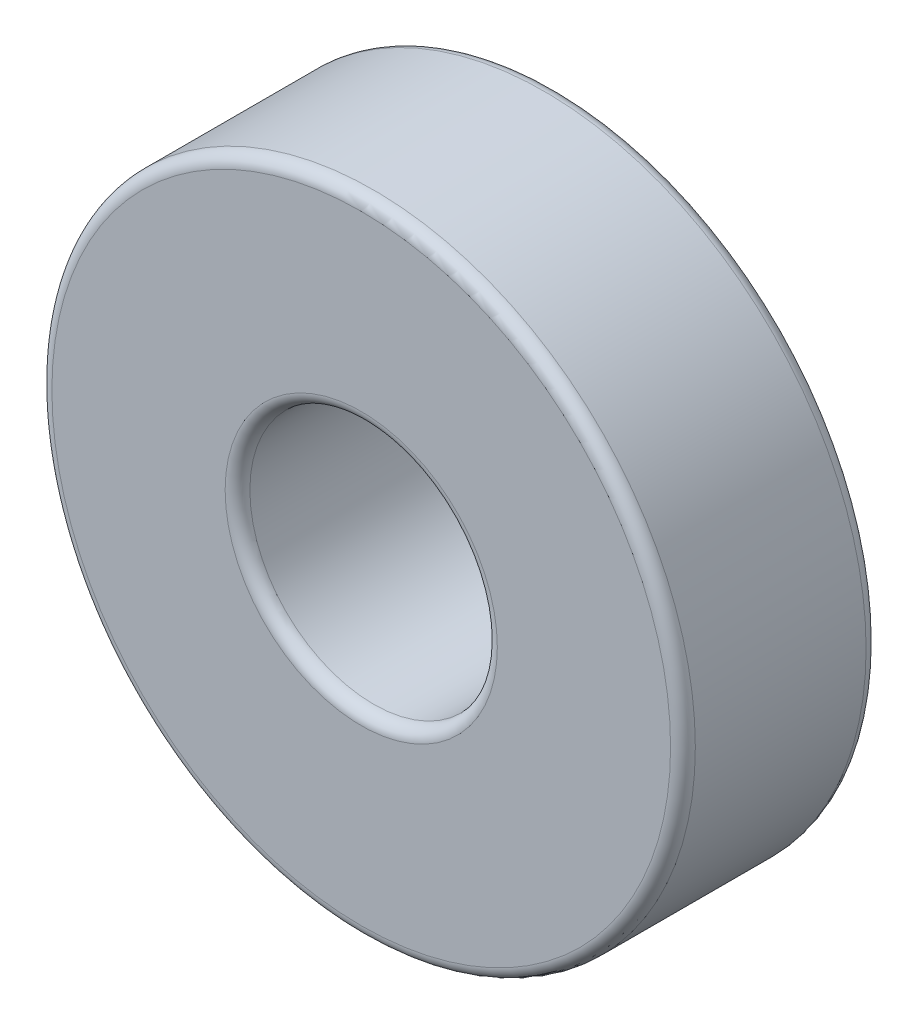
ISO-10303-21;
HEADER;
FILE_DESCRIPTION(('STEP AP214'),'2;1');
FILE_NAME('part.step','',(''),(''),'','','');
FILE_SCHEMA(('AUTOMOTIVE_DESIGN { 1 0 10303 214 1 1 1 1 }'));
ENDSEC;
DATA;
#1=APPLICATION_CONTEXT('core data for automotive mechanical design processes');
#2=APPLICATION_PROTOCOL_DEFINITION('international standard','automotive_design',2000,#1);
#3=PRODUCT_CONTEXT('',#1,'mechanical');
#4=PRODUCT('Part','Part','',(#3));
#5=PRODUCT_RELATED_PRODUCT_CATEGORY('part','',(#4));
#6=PRODUCT_DEFINITION_FORMATION('','',#4);
#7=PRODUCT_DEFINITION_CONTEXT('part definition',#1,'design');
#8=PRODUCT_DEFINITION('design','',#6,#7);
#9=PRODUCT_DEFINITION_SHAPE('','',#8);
#10=(LENGTH_UNIT() NAMED_UNIT(*) SI_UNIT(.MILLI.,.METRE.));
#11=(NAMED_UNIT(*) PLANE_ANGLE_UNIT() SI_UNIT($,.RADIAN.));
#12=(NAMED_UNIT(*) SI_UNIT($,.STERADIAN.) SOLID_ANGLE_UNIT());
#13=UNCERTAINTY_MEASURE_WITH_UNIT(LENGTH_MEASURE(1.E-05),#10,'distance_accuracy_value','');
#14=(GEOMETRIC_REPRESENTATION_CONTEXT(3) GLOBAL_UNCERTAINTY_ASSIGNED_CONTEXT((#13)) GLOBAL_UNIT_ASSIGNED_CONTEXT((#10,
#11,#12)) REPRESENTATION_CONTEXT('',''));
#15=CARTESIAN_POINT('',(0.,0.,0.));
#16=DIRECTION('',(0.,0.,1.));
#17=DIRECTION('',(1.,0.,0.));
#18=AXIS2_PLACEMENT_3D('',#15,#16,#17);
#19=CARTESIAN_POINT('',(0.,0.,7.9));
#20=DIRECTION('',(0.,0.,1.));
#21=DIRECTION('',(1.,0.,0.));
#22=AXIS2_PLACEMENT_3D('',#19,#20,#21);
#23=PLANE('',#22);
#24=CARTESIAN_POINT('',(0.,0.,7.9));
#25=DIRECTION('',(0.,0.,1.));
#26=DIRECTION('',(1.,0.,0.));
#27=AXIS2_PLACEMENT_3D('',#24,#25,#26);
#28=CIRCLE('',#27,5.5);
#29=CARTESIAN_POINT('',(5.5,0.,7.9));
#30=VERTEX_POINT('',#29);
#31=EDGE_CURVE('E43',#30,#30,#28,.F.);
#32=ORIENTED_EDGE('',*,*,#31,.T.);
#33=EDGE_LOOP('',(#32));
#34=FACE_BOUND('',#33,.T.);
#35=CARTESIAN_POINT('',(0.,0.,7.9));
#36=DIRECTION('',(0.,0.,1.));
#37=DIRECTION('',(1.,0.,0.));
#38=AXIS2_PLACEMENT_3D('',#35,#36,#37);
#39=CIRCLE('',#38,12.5);
#40=CARTESIAN_POINT('',(12.5,0.,7.9));
#41=VERTEX_POINT('',#40);
#42=EDGE_CURVE('E47',#41,#41,#39,.T.);
#43=ORIENTED_EDGE('',*,*,#42,.T.);
#44=EDGE_LOOP('',(#43));
#45=FACE_BOUND('',#44,.T.);
#46=ADVANCED_FACE('F32',(#34,#45),#23,.T.);
#47=CARTESIAN_POINT('',(0.,0.,0.));
#48=DIRECTION('',(0.,0.,1.));
#49=DIRECTION('',(1.,0.,0.));
#50=AXIS2_PLACEMENT_3D('',#47,#48,#49);
#51=PLANE('',#50);
#52=CARTESIAN_POINT('',(0.,0.,0.));
#53=DIRECTION('',(0.,0.,1.));
#54=DIRECTION('',(1.,0.,0.));
#55=AXIS2_PLACEMENT_3D('',#52,#53,#54);
#56=CIRCLE('',#55,5.5);
#57=CARTESIAN_POINT('',(5.5,0.,0.));
#58=VERTEX_POINT('',#57);
#59=EDGE_CURVE('E58',#58,#58,#56,.T.);
#60=ORIENTED_EDGE('',*,*,#59,.T.);
#61=EDGE_LOOP('',(#60));
#62=FACE_BOUND('',#61,.T.);
#63=CARTESIAN_POINT('',(0.,0.,0.));
#64=DIRECTION('',(0.,0.,1.));
#65=DIRECTION('',(1.,0.,0.));
#66=AXIS2_PLACEMENT_3D('',#63,#64,#65);
#67=CIRCLE('',#66,12.5);
#68=CARTESIAN_POINT('',(12.5,0.,0.));
#69=VERTEX_POINT('',#68);
#70=EDGE_CURVE('E61',#69,#69,#67,.F.);
#71=ORIENTED_EDGE('',*,*,#70,.T.);
#72=EDGE_LOOP('',(#71));
#73=FACE_BOUND('',#72,.T.);
#74=ADVANCED_FACE('F65',(#62,#73),#51,.F.);
#75=CARTESIAN_POINT('',(0.,0.,7.9));
#76=DIRECTION('',(0.,0.,-1.));
#77=DIRECTION('',(-1.,0.,0.));
#78=AXIS2_PLACEMENT_3D('',#75,#76,#77);
#79=CYLINDRICAL_SURFACE('',#78,13.);
#80=CARTESIAN_POINT('',(0.,0.,0.5));
#81=DIRECTION('',(0.,0.,1.));
#82=DIRECTION('',(1.,0.,0.));
#83=AXIS2_PLACEMENT_3D('',#80,#81,#82);
#84=CIRCLE('',#83,13.);
#85=CARTESIAN_POINT('',(13.,0.,0.5));
#86=VERTEX_POINT('',#85);
#87=EDGE_CURVE('E10',#86,#86,#84,.T.);
#88=ORIENTED_EDGE('',*,*,#87,.T.);
#89=EDGE_LOOP('',(#88));
#90=FACE_BOUND('',#89,.T.);
#91=CARTESIAN_POINT('',(0.,0.,7.4));
#92=DIRECTION('',(0.,0.,1.));
#93=DIRECTION('',(1.,0.,0.));
#94=AXIS2_PLACEMENT_3D('',#91,#92,#93);
#95=CIRCLE('',#94,13.);
#96=CARTESIAN_POINT('',(13.,0.,7.4));
#97=VERTEX_POINT('',#96);
#98=EDGE_CURVE('E39',#97,#97,#95,.F.);
#99=ORIENTED_EDGE('',*,*,#98,.T.);
#100=EDGE_LOOP('',(#99));
#101=FACE_BOUND('',#100,.T.);
#102=ADVANCED_FACE('F85',(#90,#101),#79,.T.);
#103=CARTESIAN_POINT('',(0.,0.,7.9));
#104=DIRECTION('',(0.,0.,-1.));
#105=DIRECTION('',(-1.,0.,0.));
#106=AXIS2_PLACEMENT_3D('',#103,#104,#105);
#107=CYLINDRICAL_SURFACE('',#106,5.);
#108=CARTESIAN_POINT('',(0.,0.,0.5));
#109=DIRECTION('',(0.,0.,1.));
#110=DIRECTION('',(1.,0.,0.));
#111=AXIS2_PLACEMENT_3D('',#108,#109,#110);
#112=CIRCLE('',#111,5.);
#113=CARTESIAN_POINT('',(5.,0.,0.5));
#114=VERTEX_POINT('',#113);
#115=EDGE_CURVE('E52',#114,#114,#112,.F.);
#116=ORIENTED_EDGE('',*,*,#115,.T.);
#117=EDGE_LOOP('',(#116));
#118=FACE_BOUND('',#117,.T.);
#119=CARTESIAN_POINT('',(0.,0.,7.4));
#120=DIRECTION('',(0.,0.,1.));
#121=DIRECTION('',(1.,0.,0.));
#122=AXIS2_PLACEMENT_3D('',#119,#120,#121);
#123=CIRCLE('',#122,5.);
#124=CARTESIAN_POINT('',(5.,0.,7.4));
#125=VERTEX_POINT('',#124);
#126=EDGE_CURVE('E55',#125,#125,#123,.T.);
#127=ORIENTED_EDGE('',*,*,#126,.T.);
#128=EDGE_LOOP('',(#127));
#129=FACE_BOUND('',#128,.T.);
#130=ADVANCED_FACE('F90',(#118,#129),#107,.F.);
#131=CARTESIAN_POINT('',(0.,0.,0.5));
#132=DIRECTION('',(0.,0.,1.));
#133=DIRECTION('',(1.,0.,0.));
#134=AXIS2_PLACEMENT_3D('',#131,#132,#133);
#135=TOROIDAL_SURFACE('',#134,5.5,0.5);
#136=ORIENTED_EDGE('',*,*,#115,.F.);
#137=EDGE_LOOP('',(#136));
#138=FACE_BOUND('',#137,.T.);
#139=ORIENTED_EDGE('',*,*,#59,.F.);
#140=EDGE_LOOP('',(#139));
#141=FACE_BOUND('',#140,.T.);
#142=ADVANCED_FACE('F76',(#138,#141),#135,.T.);
#143=CARTESIAN_POINT('',(0.,0.,7.4));
#144=DIRECTION('',(0.,0.,1.));
#145=DIRECTION('',(1.,0.,0.));
#146=AXIS2_PLACEMENT_3D('',#143,#144,#145);
#147=TOROIDAL_SURFACE('',#146,5.5,0.5);
#148=ORIENTED_EDGE('',*,*,#31,.F.);
#149=EDGE_LOOP('',(#148));
#150=FACE_BOUND('',#149,.T.);
#151=ORIENTED_EDGE('',*,*,#126,.F.);
#152=EDGE_LOOP('',(#151));
#153=FACE_BOUND('',#152,.T.);
#154=ADVANCED_FACE('F70',(#150,#153),#147,.T.);
#155=CARTESIAN_POINT('',(0.,0.,0.5));
#156=DIRECTION('',(0.,0.,1.));
#157=DIRECTION('',(1.,0.,0.));
#158=AXIS2_PLACEMENT_3D('',#155,#156,#157);
#159=TOROIDAL_SURFACE('',#158,12.5,0.5);
#160=ORIENTED_EDGE('',*,*,#70,.F.);
#161=EDGE_LOOP('',(#160));
#162=FACE_BOUND('',#161,.T.);
#163=ORIENTED_EDGE('',*,*,#87,.F.);
#164=EDGE_LOOP('',(#163));
#165=FACE_BOUND('',#164,.T.);
#166=ADVANCED_FACE('F67',(#162,#165),#159,.T.);
#167=CARTESIAN_POINT('',(0.,0.,7.4));
#168=DIRECTION('',(0.,0.,1.));
#169=DIRECTION('',(1.,0.,0.));
#170=AXIS2_PLACEMENT_3D('',#167,#168,#169);
#171=TOROIDAL_SURFACE('',#170,12.5,0.5);
#172=ORIENTED_EDGE('',*,*,#98,.F.);
#173=EDGE_LOOP('',(#172));
#174=FACE_BOUND('',#173,.T.);
#175=ORIENTED_EDGE('',*,*,#42,.F.);
#176=EDGE_LOOP('',(#175));
#177=FACE_BOUND('',#176,.T.);
#178=ADVANCED_FACE('F34',(#174,#177),#171,.T.);
#179=CLOSED_SHELL('',(#46,#74,#102,#130,#142,#154,#166,#178));
#180=MANIFOLD_SOLID_BREP('B2',#179);
#181=ADVANCED_BREP_SHAPE_REPRESENTATION('',(#18,#180),#14);
#182=SHAPE_DEFINITION_REPRESENTATION(#9,#181);
ENDSEC;
END-ISO-10303-21;
